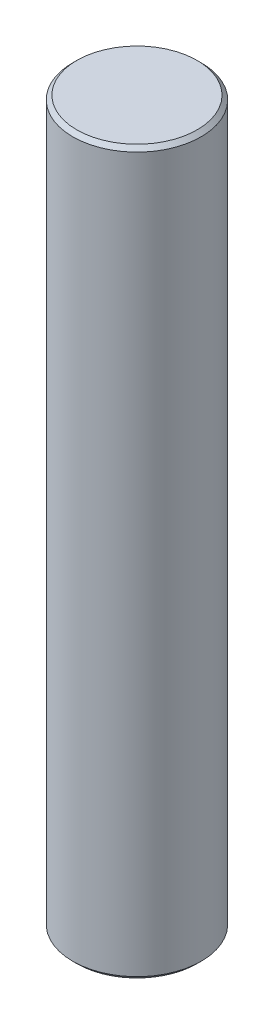
ISO-10303-21;
HEADER;
FILE_DESCRIPTION(('STEP AP214'),'2;1');
FILE_NAME('part.step','',(''),(''),'','','');
FILE_SCHEMA(('AUTOMOTIVE_DESIGN { 1 0 10303 214 1 1 1 1 }'));
ENDSEC;
DATA;
#1=APPLICATION_CONTEXT('core data for automotive mechanical design processes');
#2=APPLICATION_PROTOCOL_DEFINITION('international standard','automotive_design',2000,#1);
#3=PRODUCT_CONTEXT('',#1,'mechanical');
#4=PRODUCT('Part','Part','',(#3));
#5=PRODUCT_RELATED_PRODUCT_CATEGORY('part','',(#4));
#6=PRODUCT_DEFINITION_FORMATION('','',#4);
#7=PRODUCT_DEFINITION_CONTEXT('part definition',#1,'design');
#8=PRODUCT_DEFINITION('design','',#6,#7);
#9=PRODUCT_DEFINITION_SHAPE('','',#8);
#10=(LENGTH_UNIT() NAMED_UNIT(*) SI_UNIT(.MILLI.,.METRE.));
#11=(NAMED_UNIT(*) PLANE_ANGLE_UNIT() SI_UNIT($,.RADIAN.));
#12=(NAMED_UNIT(*) SI_UNIT($,.STERADIAN.) SOLID_ANGLE_UNIT());
#13=UNCERTAINTY_MEASURE_WITH_UNIT(LENGTH_MEASURE(1.E-05),#10,'distance_accuracy_value','');
#14=(GEOMETRIC_REPRESENTATION_CONTEXT(3) GLOBAL_UNCERTAINTY_ASSIGNED_CONTEXT((#13)) GLOBAL_UNIT_ASSIGNED_CONTEXT((#10,
#11,#12)) REPRESENTATION_CONTEXT('',''));
#15=CARTESIAN_POINT('',(0.,0.,0.));
#16=DIRECTION('',(0.,0.,1.));
#17=DIRECTION('',(1.,0.,0.));
#18=AXIS2_PLACEMENT_3D('',#15,#16,#17);
#19=CARTESIAN_POINT('',(0.,180.,0.));
#20=DIRECTION('',(0.,-1.,0.));
#21=DIRECTION('',(0.,0.,-1.));
#22=AXIS2_PLACEMENT_3D('',#19,#20,#21);
#23=CYLINDRICAL_SURFACE('',#22,16.);
#24=CARTESIAN_POINT('',(0.,1.00000000000011,0.));
#25=DIRECTION('',(0.,1.,0.));
#26=DIRECTION('',(0.,0.,1.));
#27=AXIS2_PLACEMENT_3D('',#24,#25,#26);
#28=CIRCLE('',#27,16.);
#29=CARTESIAN_POINT('',(0.,1.00000000000011,16.));
#30=VERTEX_POINT('',#29);
#31=EDGE_CURVE('E42',#30,#30,#28,.T.);
#32=ORIENTED_EDGE('',*,*,#31,.T.);
#33=EDGE_LOOP('',(#32));
#34=FACE_BOUND('',#33,.T.);
#35=CARTESIAN_POINT('',(0.,179.,0.));
#36=DIRECTION('',(0.,1.,0.));
#37=DIRECTION('',(0.,0.,1.));
#38=AXIS2_PLACEMENT_3D('',#35,#36,#37);
#39=CIRCLE('',#38,16.);
#40=CARTESIAN_POINT('',(0.,179.,16.));
#41=VERTEX_POINT('',#40);
#42=EDGE_CURVE('E46',#41,#41,#39,.F.);
#43=ORIENTED_EDGE('',*,*,#42,.T.);
#44=EDGE_LOOP('',(#43));
#45=FACE_BOUND('',#44,.T.);
#46=ADVANCED_FACE('F31',(#34,#45),#23,.T.);
#47=CARTESIAN_POINT('',(0.,180.,0.));
#48=DIRECTION('',(0.,1.,0.));
#49=DIRECTION('',(0.,0.,1.));
#50=AXIS2_PLACEMENT_3D('',#47,#48,#49);
#51=PLANE('',#50);
#52=CARTESIAN_POINT('',(0.,180.,0.));
#53=DIRECTION('',(0.,1.,0.));
#54=DIRECTION('',(0.,0.,1.));
#55=AXIS2_PLACEMENT_3D('',#52,#53,#54);
#56=CIRCLE('',#55,15.0000000000001);
#57=CARTESIAN_POINT('',(0.,180.,15.0000000000001));
#58=VERTEX_POINT('',#57);
#59=EDGE_CURVE('E10',#58,#58,#56,.T.);
#60=ORIENTED_EDGE('',*,*,#59,.T.);
#61=EDGE_LOOP('',(#60));
#62=FACE_BOUND('',#61,.T.);
#63=ADVANCED_FACE('F62',(#62),#51,.T.);
#64=CARTESIAN_POINT('',(0.,0.,0.));
#65=DIRECTION('',(0.,1.,0.));
#66=DIRECTION('',(0.,0.,1.));
#67=AXIS2_PLACEMENT_3D('',#64,#65,#66);
#68=PLANE('',#67);
#69=CARTESIAN_POINT('',(0.,0.,0.));
#70=DIRECTION('',(0.,1.,0.));
#71=DIRECTION('',(0.,0.,1.));
#72=AXIS2_PLACEMENT_3D('',#69,#70,#71);
#73=CIRCLE('',#72,14.9999999999999);
#74=CARTESIAN_POINT('',(0.,0.,14.9999999999999));
#75=VERTEX_POINT('',#74);
#76=EDGE_CURVE('E38',#75,#75,#73,.F.);
#77=ORIENTED_EDGE('',*,*,#76,.T.);
#78=EDGE_LOOP('',(#77));
#79=FACE_BOUND('',#78,.T.);
#80=ADVANCED_FACE('F59',(#79),#68,.F.);
#81=CARTESIAN_POINT('',(0.,1.00000000000011,0.));
#82=DIRECTION('',(0.,1.,0.));
#83=DIRECTION('',(0.,0.,1.));
#84=AXIS2_PLACEMENT_3D('',#81,#82,#83);
#85=CONICAL_SURFACE('',#84,16.,0.785398163397459);
#86=ORIENTED_EDGE('',*,*,#76,.F.);
#87=EDGE_LOOP('',(#86));
#88=FACE_BOUND('',#87,.T.);
#89=ORIENTED_EDGE('',*,*,#31,.F.);
#90=EDGE_LOOP('',(#89));
#91=FACE_BOUND('',#90,.T.);
#92=ADVANCED_FACE('F55',(#88,#91),#85,.T.);
#93=CARTESIAN_POINT('',(0.,180.,0.));
#94=DIRECTION('',(0.,-1.,0.));
#95=DIRECTION('',(0.,0.,-1.));
#96=AXIS2_PLACEMENT_3D('',#93,#94,#95);
#97=CONICAL_SURFACE('',#96,15.0000000000001,0.785398163397429);
#98=ORIENTED_EDGE('',*,*,#42,.F.);
#99=EDGE_LOOP('',(#98));
#100=FACE_BOUND('',#99,.T.);
#101=ORIENTED_EDGE('',*,*,#59,.F.);
#102=EDGE_LOOP('',(#101));
#103=FACE_BOUND('',#102,.T.);
#104=ADVANCED_FACE('F33',(#100,#103),#97,.T.);
#105=CLOSED_SHELL('',(#46,#63,#80,#92,#104));
#106=MANIFOLD_SOLID_BREP('B2',#105);
#107=ADVANCED_BREP_SHAPE_REPRESENTATION('',(#18,#106),#14);
#108=SHAPE_DEFINITION_REPRESENTATION(#9,#107);
ENDSEC;
END-ISO-10303-21;
